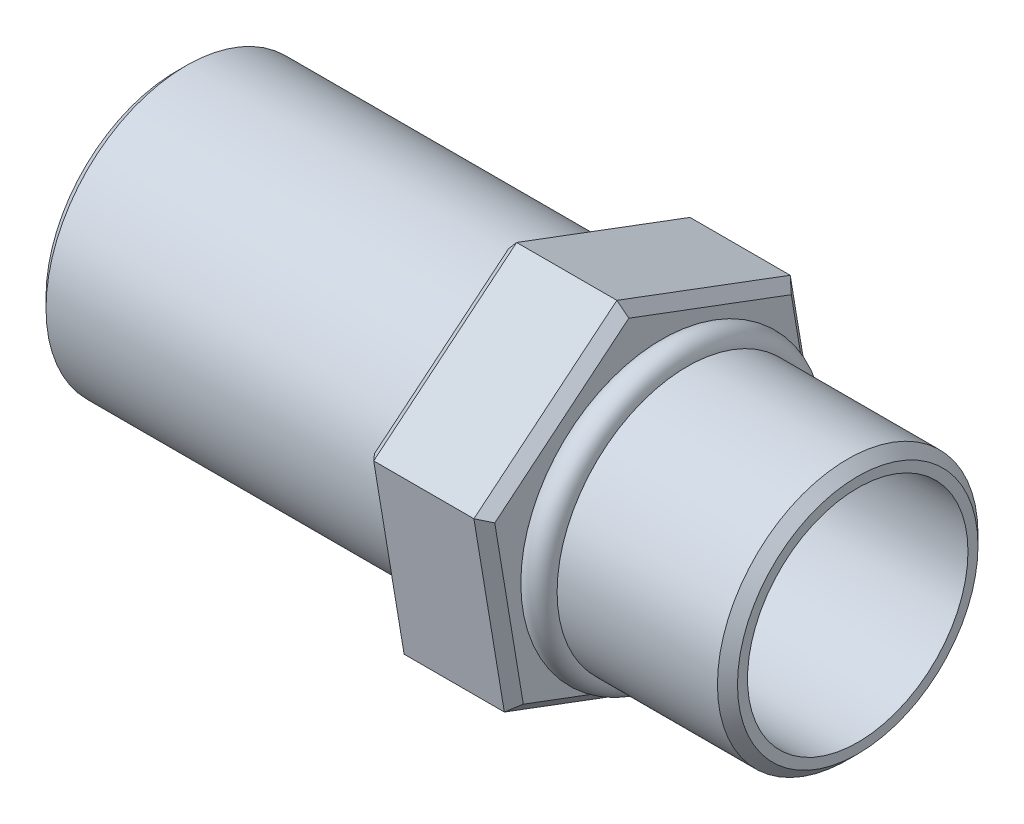
ISO-10303-21;
HEADER;
FILE_DESCRIPTION(('STEP AP214'),'2;1');
FILE_NAME('part.step','',(''),(''),'','','');
FILE_SCHEMA(('AUTOMOTIVE_DESIGN { 1 0 10303 214 1 1 1 1 }'));
ENDSEC;
DATA;
#1=APPLICATION_CONTEXT('core data for automotive mechanical design processes');
#2=APPLICATION_PROTOCOL_DEFINITION('international standard','automotive_design',2000,#1);
#3=PRODUCT_CONTEXT('',#1,'mechanical');
#4=PRODUCT('Part','Part','',(#3));
#5=PRODUCT_RELATED_PRODUCT_CATEGORY('part','',(#4));
#6=PRODUCT_DEFINITION_FORMATION('','',#4);
#7=PRODUCT_DEFINITION_CONTEXT('part definition',#1,'design');
#8=PRODUCT_DEFINITION('design','',#6,#7);
#9=PRODUCT_DEFINITION_SHAPE('','',#8);
#10=(LENGTH_UNIT() NAMED_UNIT(*) SI_UNIT(.MILLI.,.METRE.));
#11=(NAMED_UNIT(*) PLANE_ANGLE_UNIT() SI_UNIT($,.RADIAN.));
#12=(NAMED_UNIT(*) SI_UNIT($,.STERADIAN.) SOLID_ANGLE_UNIT());
#13=UNCERTAINTY_MEASURE_WITH_UNIT(LENGTH_MEASURE(1.E-05),#10,'distance_accuracy_value','');
#14=(GEOMETRIC_REPRESENTATION_CONTEXT(3) GLOBAL_UNCERTAINTY_ASSIGNED_CONTEXT((#13)) GLOBAL_UNIT_ASSIGNED_CONTEXT((#10,
#11,#12)) REPRESENTATION_CONTEXT('',''));
#15=CARTESIAN_POINT('',(0.,0.,0.));
#16=DIRECTION('',(0.,0.,1.));
#17=DIRECTION('',(1.,0.,0.));
#18=AXIS2_PLACEMENT_3D('',#15,#16,#17);
#19=CARTESIAN_POINT('',(10.,0.,0.));
#20=DIRECTION('',(-1.,0.,0.));
#21=DIRECTION('',(0.,0.,1.));
#22=AXIS2_PLACEMENT_3D('',#19,#20,#21);
#23=CYLINDRICAL_SURFACE('',#22,6.5);
#24=CARTESIAN_POINT('',(9.49999999999999,0.,0.));
#25=DIRECTION('',(1.,0.,0.));
#26=DIRECTION('',(0.,0.,-1.));
#27=AXIS2_PLACEMENT_3D('',#24,#25,#26);
#28=CIRCLE('',#27,6.5);
#29=CARTESIAN_POINT('',(9.49999999999999,0.,-6.5));
#30=VERTEX_POINT('',#29);
#31=EDGE_CURVE('E246',#30,#30,#28,.F.);
#32=ORIENTED_EDGE('',*,*,#31,.T.);
#33=EDGE_LOOP('',(#32));
#34=FACE_BOUND('',#33,.T.);
#35=CARTESIAN_POINT('',(1.5,0.,0.));
#36=DIRECTION('',(1.,0.,0.));
#37=DIRECTION('',(0.,0.,-1.));
#38=AXIS2_PLACEMENT_3D('',#35,#36,#37);
#39=CIRCLE('',#38,6.5);
#40=CARTESIAN_POINT('',(1.5,0.,-6.5));
#41=VERTEX_POINT('',#40);
#42=EDGE_CURVE('E161',#41,#41,#39,.T.);
#43=ORIENTED_EDGE('',*,*,#42,.T.);
#44=EDGE_LOOP('',(#43));
#45=FACE_BOUND('',#44,.T.);
#46=ADVANCED_FACE('F38',(#34,#45),#23,.T.);
#47=CARTESIAN_POINT('',(10.,0.,0.));
#48=DIRECTION('',(1.,0.,0.));
#49=DIRECTION('',(0.,0.,-1.));
#50=AXIS2_PLACEMENT_3D('',#47,#48,#49);
#51=PLANE('',#50);
#52=CARTESIAN_POINT('',(10.,0.,0.));
#53=DIRECTION('',(1.,0.,0.));
#54=DIRECTION('',(0.,0.,-1.));
#55=AXIS2_PLACEMENT_3D('',#52,#53,#54);
#56=CIRCLE('',#55,5.99999999999999);
#57=CARTESIAN_POINT('',(10.,0.,-5.99999999999999));
#58=VERTEX_POINT('',#57);
#59=EDGE_CURVE('E222',#58,#58,#56,.T.);
#60=ORIENTED_EDGE('',*,*,#59,.T.);
#61=EDGE_LOOP('',(#60));
#62=FACE_BOUND('',#61,.T.);
#63=CARTESIAN_POINT('',(10.,0.,0.));
#64=DIRECTION('',(1.,0.,0.));
#65=DIRECTION('',(0.,0.,-1.));
#66=AXIS2_PLACEMENT_3D('',#63,#64,#65);
#67=CIRCLE('',#66,5.5);
#68=CARTESIAN_POINT('',(10.,0.,-5.5));
#69=VERTEX_POINT('',#68);
#70=EDGE_CURVE('E243',#69,#69,#67,.T.);
#71=ORIENTED_EDGE('',*,*,#70,.F.);
#72=EDGE_LOOP('',(#71));
#73=FACE_BOUND('',#72,.T.);
#74=ADVANCED_FACE('F285',(#62,#73),#51,.T.);
#75=CARTESIAN_POINT('',(0.75,0.,0.));
#76=DIRECTION('',(1.,0.,0.));
#77=DIRECTION('',(0.,0.,-1.));
#78=AXIS2_PLACEMENT_3D('',#75,#76,#77);
#79=TOROIDAL_SURFACE('',#78,6.5,0.75);
#80=CARTESIAN_POINT('',(0.,0.,0.));
#81=DIRECTION('',(1.,0.,0.));
#82=DIRECTION('',(0.,0.,-1.));
#83=AXIS2_PLACEMENT_3D('',#80,#81,#82);
#84=CIRCLE('',#83,6.5);
#85=CARTESIAN_POINT('',(0.,0.,-6.5));
#86=VERTEX_POINT('',#85);
#87=EDGE_CURVE('E164',#86,#86,#84,.F.);
#88=ORIENTED_EDGE('',*,*,#87,.F.);
#89=EDGE_LOOP('',(#88));
#90=FACE_BOUND('',#89,.T.);
#91=ORIENTED_EDGE('',*,*,#42,.F.);
#92=EDGE_LOOP('',(#91));
#93=FACE_BOUND('',#92,.T.);
#94=ADVANCED_FACE('F291',(#90,#93),#79,.T.);
#95=CARTESIAN_POINT('',(-6.,-9.11201705266674,-1.51805090996447));
#96=DIRECTION('',(0.,0.936418514454213,-0.350885117648731));
#97=DIRECTION('',(0.,0.350885117648731,0.936418514454214));
#98=AXIS2_PLACEMENT_3D('',#95,#96,#97);
#99=PLANE('',#98);
#100=DIRECTION('',(1.,0.,0.));
#101=VECTOR('',#100,1.);
#102=CARTESIAN_POINT('',(-6.,-9.11201705266674,-1.51805090996447));
#103=LINE('',#102,#101);
#104=CARTESIAN_POINT('',(-5.5,-9.11201705266674,-1.51805090996447));
#105=VERTEX_POINT('',#104);
#106=CARTESIAN_POINT('',(-0.499999999999997,-9.11201705266674,-1.51805090996447));
#107=VERTEX_POINT('',#106);
#108=EDGE_CURVE('E198',#105,#107,#103,.T.);
#109=ORIENTED_EDGE('',*,*,#108,.T.);
#110=DIRECTION('',(0.,0.350885117648731,0.936418514454214));
#111=VECTOR('',#110,1.);
#112=CARTESIAN_POINT('',(-0.499999999999997,-9.11201705266674,-1.51805090996447));
#113=LINE('',#112,#111);
#114=CARTESIAN_POINT('',(-0.499999999999997,-5.87067917860069,7.13221279234417));
#115=VERTEX_POINT('',#114);
#116=EDGE_CURVE('E218',#107,#115,#113,.T.);
#117=ORIENTED_EDGE('',*,*,#116,.T.);
#118=DIRECTION('',(1.,0.,0.));
#119=VECTOR('',#118,1.);
#120=CARTESIAN_POINT('',(-6.,-5.87067917860069,7.13221279234417));
#121=LINE('',#120,#119);
#122=CARTESIAN_POINT('',(-5.5,-5.87067917860069,7.13221279234417));
#123=VERTEX_POINT('',#122);
#124=EDGE_CURVE('E376',#123,#115,#121,.T.);
#125=ORIENTED_EDGE('',*,*,#124,.F.);
#126=DIRECTION('',(0.,-0.350885117648731,-0.936418514454214));
#127=VECTOR('',#126,1.);
#128=CARTESIAN_POINT('',(-5.5,-9.11201705266674,-1.51805090996447));
#129=LINE('',#128,#127);
#130=EDGE_CURVE('E185',#123,#105,#129,.T.);
#131=ORIENTED_EDGE('',*,*,#130,.T.);
#132=EDGE_LOOP('',(#109,#117,#125,#131));
#133=FACE_BOUND('',#132,.T.);
#134=ADVANCED_FACE('F385',(#133),#99,.F.);
#135=CARTESIAN_POINT('',(-6.,-5.87067917860069,7.13221279234417));
#136=DIRECTION('',(0.,0.164333831533414,-0.9864047809158));
#137=DIRECTION('',(0.,0.9864047809158,0.164333831533414));
#138=AXIS2_PLACEMENT_3D('',#135,#136,#137);
#139=PLANE('',#138);
#140=ORIENTED_EDGE('',*,*,#124,.T.);
#141=DIRECTION('',(0.,0.9864047809158,0.164333831533414));
#142=VECTOR('',#141,1.);
#143=CARTESIAN_POINT('',(-0.499999999999997,-5.87067917860069,7.13221279234417));
#144=LINE('',#143,#142);
#145=CARTESIAN_POINT('',(-0.499999999999997,3.24133787406605,8.65026370230864));
#146=VERTEX_POINT('',#145);
#147=EDGE_CURVE('E216',#115,#146,#144,.T.);
#148=ORIENTED_EDGE('',*,*,#147,.T.);
#149=DIRECTION('',(1.,0.,0.));
#150=VECTOR('',#149,1.);
#151=CARTESIAN_POINT('',(-6.,3.24133787406605,8.65026370230864));
#152=LINE('',#151,#150);
#153=CARTESIAN_POINT('',(-5.5,3.24133787406605,8.65026370230864));
#154=VERTEX_POINT('',#153);
#155=EDGE_CURVE('E373',#154,#146,#152,.T.);
#156=ORIENTED_EDGE('',*,*,#155,.F.);
#157=DIRECTION('',(0.,-0.9864047809158,-0.164333831533414));
#158=VECTOR('',#157,1.);
#159=CARTESIAN_POINT('',(-5.5,-5.87067917860069,7.13221279234417));
#160=LINE('',#159,#158);
#161=EDGE_CURVE('E175',#154,#123,#160,.T.);
#162=ORIENTED_EDGE('',*,*,#161,.T.);
#163=EDGE_LOOP('',(#140,#148,#156,#162));
#164=FACE_BOUND('',#163,.T.);
#165=ADVANCED_FACE('F390',(#164),#139,.F.);
#166=CARTESIAN_POINT('',(-6.,3.24133787406605,8.65026370230864));
#167=DIRECTION('',(0.,-0.772084682920799,-0.635519663267069));
#168=DIRECTION('',(0.,0.635519663267069,-0.772084682920799));
#169=AXIS2_PLACEMENT_3D('',#166,#167,#168);
#170=PLANE('',#169);
#171=ORIENTED_EDGE('',*,*,#155,.T.);
#172=DIRECTION('',(0.,0.635519663267069,-0.772084682920799));
#173=VECTOR('',#172,1.);
#174=CARTESIAN_POINT('',(-0.499999999999997,3.24133787406605,8.65026370230864));
#175=LINE('',#174,#173);
#176=CARTESIAN_POINT('',(-0.499999999999997,9.11201705266674,1.51805090996447));
#177=VERTEX_POINT('',#176);
#178=EDGE_CURVE('E214',#146,#177,#175,.T.);
#179=ORIENTED_EDGE('',*,*,#178,.T.);
#180=DIRECTION('',(1.,0.,0.));
#181=VECTOR('',#180,1.);
#182=CARTESIAN_POINT('',(-6.,9.11201705266674,1.51805090996447));
#183=LINE('',#182,#181);
#184=CARTESIAN_POINT('',(-5.5,9.11201705266674,1.51805090996447));
#185=VERTEX_POINT('',#184);
#186=EDGE_CURVE('E370',#185,#177,#183,.T.);
#187=ORIENTED_EDGE('',*,*,#186,.F.);
#188=DIRECTION('',(0.,-0.635519663267069,0.772084682920799));
#189=VECTOR('',#188,1.);
#190=CARTESIAN_POINT('',(-5.5,3.24133787406605,8.65026370230864));
#191=LINE('',#190,#189);
#192=EDGE_CURVE('E178',#185,#154,#191,.T.);
#193=ORIENTED_EDGE('',*,*,#192,.T.);
#194=EDGE_LOOP('',(#171,#179,#187,#193));
#195=FACE_BOUND('',#194,.T.);
#196=ADVANCED_FACE('F396',(#195),#170,.F.);
#197=CARTESIAN_POINT('',(-6.,9.11201705266674,1.51805090996447));
#198=DIRECTION('',(0.,-0.936418514454214,0.350885117648731));
#199=DIRECTION('',(0.,-0.350885117648731,-0.936418514454214));
#200=AXIS2_PLACEMENT_3D('',#197,#198,#199);
#201=PLANE('',#200);
#202=ORIENTED_EDGE('',*,*,#186,.T.);
#203=DIRECTION('',(0.,-0.350885117648731,-0.936418514454214));
#204=VECTOR('',#203,1.);
#205=CARTESIAN_POINT('',(-0.499999999999997,9.11201705266674,1.51805090996447));
#206=LINE('',#205,#204);
#207=CARTESIAN_POINT('',(-0.499999999999997,5.87067917860068,-7.13221279234416));
#208=VERTEX_POINT('',#207);
#209=EDGE_CURVE('E187',#177,#208,#206,.T.);
#210=ORIENTED_EDGE('',*,*,#209,.T.);
#211=DIRECTION('',(1.,0.,0.));
#212=VECTOR('',#211,1.);
#213=CARTESIAN_POINT('',(-6.,5.87067917860068,-7.13221279234416));
#214=LINE('',#213,#212);
#215=CARTESIAN_POINT('',(-5.5,5.87067917860068,-7.13221279234416));
#216=VERTEX_POINT('',#215);
#217=EDGE_CURVE('E368',#216,#208,#214,.T.);
#218=ORIENTED_EDGE('',*,*,#217,.F.);
#219=DIRECTION('',(0.,0.350885117648731,0.936418514454214));
#220=VECTOR('',#219,1.);
#221=CARTESIAN_POINT('',(-5.5,9.11201705266674,1.51805090996447));
#222=LINE('',#221,#220);
#223=EDGE_CURVE('E180',#216,#185,#222,.T.);
#224=ORIENTED_EDGE('',*,*,#223,.T.);
#225=EDGE_LOOP('',(#202,#210,#218,#224));
#226=FACE_BOUND('',#225,.T.);
#227=ADVANCED_FACE('F400',(#226),#201,.F.);
#228=CARTESIAN_POINT('',(-6.,5.87067917860068,-7.13221279234416));
#229=DIRECTION('',(0.,-0.164333831533414,0.9864047809158));
#230=DIRECTION('',(0.,-0.9864047809158,-0.164333831533414));
#231=AXIS2_PLACEMENT_3D('',#228,#229,#230);
#232=PLANE('',#231);
#233=ORIENTED_EDGE('',*,*,#217,.T.);
#234=DIRECTION('',(0.,-0.9864047809158,-0.164333831533414));
#235=VECTOR('',#234,1.);
#236=CARTESIAN_POINT('',(-0.499999999999997,5.87067917860068,-7.13221279234416));
#237=LINE('',#236,#235);
#238=CARTESIAN_POINT('',(-0.499999999999997,-3.24133787406605,-8.65026370230864));
#239=VERTEX_POINT('',#238);
#240=EDGE_CURVE('E59',#208,#239,#237,.T.);
#241=ORIENTED_EDGE('',*,*,#240,.T.);
#242=DIRECTION('',(1.,0.,0.));
#243=VECTOR('',#242,1.);
#244=CARTESIAN_POINT('',(-6.,-3.24133787406605,-8.65026370230864));
#245=LINE('',#244,#243);
#246=CARTESIAN_POINT('',(-5.5,-3.24133787406605,-8.65026370230864));
#247=VERTEX_POINT('',#246);
#248=EDGE_CURVE('E366',#247,#239,#245,.T.);
#249=ORIENTED_EDGE('',*,*,#248,.F.);
#250=DIRECTION('',(0.,0.9864047809158,0.164333831533414));
#251=VECTOR('',#250,1.);
#252=CARTESIAN_POINT('',(-5.5,5.87067917860068,-7.13221279234416));
#253=LINE('',#252,#251);
#254=EDGE_CURVE('E182',#247,#216,#253,.T.);
#255=ORIENTED_EDGE('',*,*,#254,.T.);
#256=EDGE_LOOP('',(#233,#241,#249,#255));
#257=FACE_BOUND('',#256,.T.);
#258=ADVANCED_FACE('F404',(#257),#232,.F.);
#259=CARTESIAN_POINT('',(-6.,-3.24133787406605,-8.65026370230864));
#260=DIRECTION('',(0.,0.772084682920799,0.635519663267069));
#261=DIRECTION('',(0.,-0.635519663267069,0.772084682920799));
#262=AXIS2_PLACEMENT_3D('',#259,#260,#261);
#263=PLANE('',#262);
#264=ORIENTED_EDGE('',*,*,#248,.T.);
#265=DIRECTION('',(0.,-0.635519663267069,0.772084682920799));
#266=VECTOR('',#265,1.);
#267=CARTESIAN_POINT('',(-0.499999999999997,-3.24133787406605,-8.65026370230864));
#268=LINE('',#267,#266);
#269=EDGE_CURVE('E66',#239,#107,#268,.T.);
#270=ORIENTED_EDGE('',*,*,#269,.T.);
#271=ORIENTED_EDGE('',*,*,#108,.F.);
#272=DIRECTION('',(0.,0.635519663267069,-0.772084682920799));
#273=VECTOR('',#272,1.);
#274=CARTESIAN_POINT('',(-5.5,-3.24133787406605,-8.65026370230864));
#275=LINE('',#274,#273);
#276=EDGE_CURVE('E152',#105,#247,#275,.T.);
#277=ORIENTED_EDGE('',*,*,#276,.T.);
#278=EDGE_LOOP('',(#264,#270,#271,#277));
#279=FACE_BOUND('',#278,.T.);
#280=ADVANCED_FACE('F408',(#279),#263,.F.);
#281=CARTESIAN_POINT('',(-6.,0.,0.));
#282=DIRECTION('',(-1.,0.,0.));
#283=DIRECTION('',(0.,0.,1.));
#284=AXIS2_PLACEMENT_3D('',#281,#282,#283);
#285=PLANE('',#284);
#286=CARTESIAN_POINT('',(-6.,0.,0.));
#287=DIRECTION('',(-1.,0.,0.));
#288=DIRECTION('',(0.,0.,1.));
#289=AXIS2_PLACEMENT_3D('',#286,#287,#288);
#290=CIRCLE('',#289,7.1);
#291=CARTESIAN_POINT('',(-6.,0.,7.1));
#292=VERTEX_POINT('',#291);
#293=EDGE_CURVE('E11',#292,#292,#290,.F.);
#294=ORIENTED_EDGE('',*,*,#293,.T.);
#295=EDGE_LOOP('',(#294));
#296=FACE_BOUND('',#295,.T.);
#297=DIRECTION('',(0.,0.350885117648731,0.936418514454214));
#298=VECTOR('',#297,1.);
#299=CARTESIAN_POINT('',(-6.,-5.40246992137358,6.9567702335198));
#300=LINE('',#299,#298);
#301=CARTESIAN_POINT('',(-6.,-8.54251598687507,-1.42317272809169));
#302=VERTEX_POINT('',#301);
#303=CARTESIAN_POINT('',(-6.,-5.50376172993814,6.68644949282266));
#304=VERTEX_POINT('',#303);
#305=EDGE_CURVE('E140',#302,#304,#300,.T.);
#306=ORIENTED_EDGE('',*,*,#305,.T.);
#307=DIRECTION('',(0.,0.9864047809158,0.164333831533414));
#308=VECTOR('',#307,1.);
#309=CARTESIAN_POINT('',(-6.,3.32350478983276,8.15706131185074));
#310=LINE('',#309,#308);
#311=CARTESIAN_POINT('',(-6.,3.03875425693693,8.10962222091435));
#312=VERTEX_POINT('',#311);
#313=EDGE_CURVE('E173',#304,#312,#310,.T.);
#314=ORIENTED_EDGE('',*,*,#313,.T.);
#315=DIRECTION('',(0.,0.635519663267069,-0.772084682920799));
#316=VECTOR('',#315,1.);
#317=CARTESIAN_POINT('',(-6.,8.72597471120634,1.20029107833094));
#318=LINE('',#317,#316);
#319=CARTESIAN_POINT('',(-6.,8.54251598687507,1.42317272809169));
#320=VERTEX_POINT('',#319);
#321=EDGE_CURVE('E171',#312,#320,#318,.T.);
#322=ORIENTED_EDGE('',*,*,#321,.T.);
#323=DIRECTION('',(0.,-0.350885117648731,-0.936418514454214));
#324=VECTOR('',#323,1.);
#325=CARTESIAN_POINT('',(-6.,5.40246992137358,-6.9567702335198));
#326=LINE('',#325,#324);
#327=CARTESIAN_POINT('',(-6.,5.50376172993814,-6.68644949282266));
#328=VERTEX_POINT('',#327);
#329=EDGE_CURVE('E169',#320,#328,#326,.T.);
#330=ORIENTED_EDGE('',*,*,#329,.T.);
#331=DIRECTION('',(0.,-0.9864047809158,-0.164333831533414));
#332=VECTOR('',#331,1.);
#333=CARTESIAN_POINT('',(-6.,-3.32350478983276,-8.15706131185073));
#334=LINE('',#333,#332);
#335=CARTESIAN_POINT('',(-6.,-3.03875425693693,-8.10962222091434));
#336=VERTEX_POINT('',#335);
#337=EDGE_CURVE('E143',#328,#336,#334,.T.);
#338=ORIENTED_EDGE('',*,*,#337,.T.);
#339=DIRECTION('',(0.,-0.635519663267069,0.772084682920799));
#340=VECTOR('',#339,1.);
#341=CARTESIAN_POINT('',(-6.,-8.72597471120634,-1.20029107833093));
#342=LINE('',#341,#340);
#343=EDGE_CURVE('E135',#336,#302,#342,.T.);
#344=ORIENTED_EDGE('',*,*,#343,.T.);
#345=EDGE_LOOP('',(#306,#314,#322,#330,#338,#344));
#346=FACE_BOUND('',#345,.T.);
#347=ADVANCED_FACE('F137',(#296,#346),#285,.T.);
#348=CARTESIAN_POINT('',(0.,0.,0.));
#349=DIRECTION('',(-1.,0.,0.));
#350=DIRECTION('',(0.,0.,1.));
#351=AXIS2_PLACEMENT_3D('',#348,#349,#350);
#352=PLANE('',#351);
#353=DIRECTION('',(0.,0.9864047809158,0.164333831533414));
#354=VECTOR('',#353,1.);
#355=CARTESIAN_POINT('',(0.,1.23250373650061,-7.39803585686849));
#356=LINE('',#355,#354);
#357=CARTESIAN_POINT('',(0.,-3.03875425693692,-8.10962222091434));
#358=VERTEX_POINT('',#357);
#359=CARTESIAN_POINT('',(0.,5.50376172993814,-6.68644949282265));
#360=VERTEX_POINT('',#359);
#361=EDGE_CURVE('E201',#358,#360,#356,.T.);
#362=ORIENTED_EDGE('',*,*,#361,.T.);
#363=DIRECTION('',(0.,0.350885117648731,0.936418514454214));
#364=VECTOR('',#363,1.);
#365=CARTESIAN_POINT('',(0.,7.0231388584066,-2.63163838236548));
#366=LINE('',#365,#364);
#367=CARTESIAN_POINT('',(0.,8.54251598687506,1.42317272809169));
#368=VERTEX_POINT('',#367);
#369=EDGE_CURVE('E211',#360,#368,#366,.T.);
#370=ORIENTED_EDGE('',*,*,#369,.T.);
#371=DIRECTION('',(0.,-0.635519663267069,0.772084682920799));
#372=VECTOR('',#371,1.);
#373=CARTESIAN_POINT('',(0.,5.79063512190599,4.76639747450302));
#374=LINE('',#373,#372);
#375=CARTESIAN_POINT('',(0.,3.03875425693692,8.10962222091434));
#376=VERTEX_POINT('',#375);
#377=EDGE_CURVE('E209',#368,#376,#374,.T.);
#378=ORIENTED_EDGE('',*,*,#377,.T.);
#379=DIRECTION('',(0.,-0.9864047809158,-0.164333831533414));
#380=VECTOR('',#379,1.);
#381=CARTESIAN_POINT('',(0.,-1.23250373650061,7.3980358568685));
#382=LINE('',#381,#380);
#383=CARTESIAN_POINT('',(0.,-5.50376172993814,6.68644949282265));
#384=VERTEX_POINT('',#383);
#385=EDGE_CURVE('E207',#376,#384,#382,.T.);
#386=ORIENTED_EDGE('',*,*,#385,.T.);
#387=DIRECTION('',(0.,-0.350885117648731,-0.936418514454214));
#388=VECTOR('',#387,1.);
#389=CARTESIAN_POINT('',(0.,-7.0231388584066,2.63163838236548));
#390=LINE('',#389,#388);
#391=CARTESIAN_POINT('',(0.,-8.54251598687507,-1.42317272809169));
#392=VERTEX_POINT('',#391);
#393=EDGE_CURVE('E205',#384,#392,#390,.T.);
#394=ORIENTED_EDGE('',*,*,#393,.T.);
#395=DIRECTION('',(0.,0.635519663267069,-0.772084682920799));
#396=VECTOR('',#395,1.);
#397=CARTESIAN_POINT('',(0.,-5.79063512190599,-4.76639747450302));
#398=LINE('',#397,#396);
#399=EDGE_CURVE('E203',#392,#358,#398,.T.);
#400=ORIENTED_EDGE('',*,*,#399,.T.);
#401=EDGE_LOOP('',(#362,#370,#378,#386,#394,#400));
#402=FACE_BOUND('',#401,.T.);
#403=ORIENTED_EDGE('',*,*,#87,.T.);
#404=EDGE_LOOP('',(#403));
#405=FACE_BOUND('',#404,.T.);
#406=ADVANCED_FACE('F381',(#402,#405),#352,.F.);
#407=CARTESIAN_POINT('',(-24.,0.,0.));
#408=DIRECTION('',(1.,0.,0.));
#409=DIRECTION('',(0.,0.,-1.));
#410=AXIS2_PLACEMENT_3D('',#407,#408,#409);
#411=CYLINDRICAL_SURFACE('',#410,7.);
#412=CARTESIAN_POINT('',(-6.1,0.,0.));
#413=DIRECTION('',(-1.,0.,0.));
#414=DIRECTION('',(0.,0.,1.));
#415=AXIS2_PLACEMENT_3D('',#412,#413,#414);
#416=CIRCLE('',#415,7.);
#417=CARTESIAN_POINT('',(-6.1,0.,7.));
#418=VERTEX_POINT('',#417);
#419=EDGE_CURVE('E51',#418,#418,#416,.T.);
#420=ORIENTED_EDGE('',*,*,#419,.T.);
#421=EDGE_LOOP('',(#420));
#422=FACE_BOUND('',#421,.T.);
#423=CARTESIAN_POINT('',(-23.5,0.,0.));
#424=DIRECTION('',(-1.,0.,0.));
#425=DIRECTION('',(0.,0.,1.));
#426=AXIS2_PLACEMENT_3D('',#423,#424,#425);
#427=CIRCLE('',#426,7.);
#428=CARTESIAN_POINT('',(-23.5,0.,7.));
#429=VERTEX_POINT('',#428);
#430=EDGE_CURVE('E252',#429,#429,#427,.F.);
#431=ORIENTED_EDGE('',*,*,#430,.T.);
#432=EDGE_LOOP('',(#431));
#433=FACE_BOUND('',#432,.T.);
#434=ADVANCED_FACE('F356',(#422,#433),#411,.T.);
#435=CARTESIAN_POINT('',(-24.,0.,0.));
#436=DIRECTION('',(-1.,0.,0.));
#437=DIRECTION('',(0.,0.,1.));
#438=AXIS2_PLACEMENT_3D('',#435,#436,#437);
#439=PLANE('',#438);
#440=CARTESIAN_POINT('',(-24.,0.,0.));
#441=DIRECTION('',(-1.,0.,0.));
#442=DIRECTION('',(0.,0.,1.));
#443=AXIS2_PLACEMENT_3D('',#440,#441,#442);
#444=CIRCLE('',#443,6.49999999999999);
#445=CARTESIAN_POINT('',(-24.,0.,6.49999999999999));
#446=VERTEX_POINT('',#445);
#447=EDGE_CURVE('E249',#446,#446,#444,.T.);
#448=ORIENTED_EDGE('',*,*,#447,.T.);
#449=EDGE_LOOP('',(#448));
#450=FACE_BOUND('',#449,.T.);
#451=CARTESIAN_POINT('',(-24.,0.,0.));
#452=DIRECTION('',(-1.,0.,0.));
#453=DIRECTION('',(0.,0.,1.));
#454=AXIS2_PLACEMENT_3D('',#451,#452,#453);
#455=CIRCLE('',#454,5.75);
#456=CARTESIAN_POINT('',(-24.,0.,5.75));
#457=VERTEX_POINT('',#456);
#458=EDGE_CURVE('E242',#457,#457,#455,.T.);
#459=ORIENTED_EDGE('',*,*,#458,.F.);
#460=EDGE_LOOP('',(#459));
#461=FACE_BOUND('',#460,.T.);
#462=ADVANCED_FACE('F317',(#450,#461),#439,.T.);
#463=CARTESIAN_POINT('',(-6.,1.23250373650061,-7.3980358568685));
#464=DIRECTION('',(-0.707106781186547,0.116201566655645,-0.697493509580393));
#465=DIRECTION('',(0.,0.9864047809158,0.164333831533414));
#466=AXIS2_PLACEMENT_3D('',#463,#464,#465);
#467=PLANE('',#466);
#468=DIRECTION('',(0.654653670707978,0.480407709227477,-0.583641160597313));
#469=VECTOR('',#468,1.);
#470=CARTESIAN_POINT('',(-7.07142857142857,4.7175100542327,-5.73124242241942));
#471=LINE('',#470,#469);
#472=EDGE_CURVE('E155',#216,#328,#471,.F.);
#473=ORIENTED_EDGE('',*,*,#472,.F.);
#474=ORIENTED_EDGE('',*,*,#254,.F.);
#475=DIRECTION('',(0.654653670707978,-0.265244217157764,-0.70786586066354));
#476=VECTOR('',#475,1.);
#477=CARTESIAN_POINT('',(-7.07142857142858,-2.60464650594594,-6.95110476078372));
#478=LINE('',#477,#476);
#479=EDGE_CURVE('E196',#336,#247,#478,.T.);
#480=ORIENTED_EDGE('',*,*,#479,.F.);
#481=ORIENTED_EDGE('',*,*,#337,.F.);
#482=EDGE_LOOP('',(#473,#474,#480,#481));
#483=FACE_BOUND('',#482,.T.);
#484=ADVANCED_FACE('F314',(#483),#467,.T.);
#485=CARTESIAN_POINT('',(-6.,-5.79063512190599,-4.76639747450302));
#486=DIRECTION('',(-0.707106781186546,-0.545946314943564,-0.449380263473537));
#487=DIRECTION('',(0.,0.635519663267069,-0.772084682920799));
#488=AXIS2_PLACEMENT_3D('',#485,#486,#487);
#489=PLANE('',#488);
#490=ORIENTED_EDGE('',*,*,#479,.T.);
#491=ORIENTED_EDGE('',*,*,#276,.F.);
#492=DIRECTION('',(0.654653670707979,-0.745651926385244,-0.124224700066228));
#493=VECTOR('',#492,1.);
#494=CARTESIAN_POINT('',(-7.07142857142857,-7.32215656017864,-1.2198623383643));
#495=LINE('',#494,#493);
#496=EDGE_CURVE('E150',#302,#105,#495,.T.);
#497=ORIENTED_EDGE('',*,*,#496,.F.);
#498=ORIENTED_EDGE('',*,*,#343,.F.);
#499=EDGE_LOOP('',(#490,#491,#497,#498));
#500=FACE_BOUND('',#499,.T.);
#501=ADVANCED_FACE('F151',(#500),#489,.T.);
#502=CARTESIAN_POINT('',(-6.,7.0231388584066,-2.63163838236548));
#503=DIRECTION('',(-0.707106781186546,0.662147881599209,-0.248113246106858));
#504=DIRECTION('',(0.,0.350885117648731,0.936418514454214));
#505=AXIS2_PLACEMENT_3D('',#502,#503,#504);
#506=PLANE('',#505);
#507=ORIENTED_EDGE('',*,*,#472,.T.);
#508=ORIENTED_EDGE('',*,*,#329,.F.);
#509=DIRECTION('',(0.654653670707979,0.745651926385244,0.124224700066227));
#510=VECTOR('',#509,1.);
#511=CARTESIAN_POINT('',(-7.07142857142857,7.32215656017863,1.21986233836431));
#512=LINE('',#511,#510);
#513=EDGE_CURVE('E156',#185,#320,#512,.F.);
#514=ORIENTED_EDGE('',*,*,#513,.F.);
#515=ORIENTED_EDGE('',*,*,#223,.F.);
#516=EDGE_LOOP('',(#507,#508,#514,#515));
#517=FACE_BOUND('',#516,.T.);
#518=ADVANCED_FACE('F308',(#517),#506,.T.);
#519=CARTESIAN_POINT('',(-6.,-7.02313885840661,2.63163838236548));
#520=DIRECTION('',(-0.707106781186546,-0.662147881599209,0.248113246106858));
#521=DIRECTION('',(0.,-0.350885117648731,-0.936418514454214));
#522=AXIS2_PLACEMENT_3D('',#519,#520,#521);
#523=PLANE('',#522);
#524=ORIENTED_EDGE('',*,*,#496,.T.);
#525=ORIENTED_EDGE('',*,*,#130,.F.);
#526=DIRECTION('',(-0.654653670707979,0.480407709227478,-0.583641160597311));
#527=VECTOR('',#526,1.);
#528=CARTESIAN_POINT('',(-7.07142857142857,-4.7175100542327,5.73124242241943));
#529=LINE('',#528,#527);
#530=EDGE_CURVE('E159',#304,#123,#529,.F.);
#531=ORIENTED_EDGE('',*,*,#530,.F.);
#532=ORIENTED_EDGE('',*,*,#305,.F.);
#533=EDGE_LOOP('',(#524,#525,#531,#532));
#534=FACE_BOUND('',#533,.T.);
#535=ADVANCED_FACE('F158',(#534),#523,.T.);
#536=CARTESIAN_POINT('',(-6.,5.790635121906,4.76639747450302));
#537=DIRECTION('',(-0.707106781186546,0.545946314943564,0.449380263473537));
#538=DIRECTION('',(0.,-0.635519663267069,0.772084682920799));
#539=AXIS2_PLACEMENT_3D('',#536,#537,#538);
#540=PLANE('',#539);
#541=ORIENTED_EDGE('',*,*,#513,.T.);
#542=ORIENTED_EDGE('',*,*,#321,.F.);
#543=DIRECTION('',(0.654653670707979,0.265244217157766,0.707865860663539));
#544=VECTOR('',#543,1.);
#545=CARTESIAN_POINT('',(-7.07142857142857,2.60464650594594,6.95110476078373));
#546=LINE('',#545,#544);
#547=EDGE_CURVE('E188',#154,#312,#546,.F.);
#548=ORIENTED_EDGE('',*,*,#547,.F.);
#549=ORIENTED_EDGE('',*,*,#192,.F.);
#550=EDGE_LOOP('',(#541,#542,#548,#549));
#551=FACE_BOUND('',#550,.T.);
#552=ADVANCED_FACE('F301',(#551),#540,.T.);
#553=CARTESIAN_POINT('',(-6.,-1.23250373650061,7.3980358568685));
#554=DIRECTION('',(-0.707106781186546,-0.116201566655645,0.697493509580395));
#555=DIRECTION('',(0.,-0.9864047809158,-0.164333831533414));
#556=AXIS2_PLACEMENT_3D('',#553,#554,#555);
#557=PLANE('',#556);
#558=ORIENTED_EDGE('',*,*,#530,.T.);
#559=ORIENTED_EDGE('',*,*,#161,.F.);
#560=ORIENTED_EDGE('',*,*,#547,.T.);
#561=ORIENTED_EDGE('',*,*,#313,.F.);
#562=EDGE_LOOP('',(#558,#559,#560,#561));
#563=FACE_BOUND('',#562,.T.);
#564=ADVANCED_FACE('F297',(#563),#557,.T.);
#565=CARTESIAN_POINT('',(-0.499999999999997,-9.11201705266674,-1.51805090996447));
#566=DIRECTION('',(-0.707106781186552,0.662147881599203,-0.248113246106856));
#567=DIRECTION('',(0.,0.350885117648731,0.936418514454214));
#568=AXIS2_PLACEMENT_3D('',#565,#566,#567);
#569=PLANE('',#568);
#570=DIRECTION('',(-0.654653670707972,-0.745651926385249,-0.124224700066229));
#571=VECTOR('',#570,1.);
#572=CARTESIAN_POINT('',(1.78571428571429,-6.50858360904764,-1.08432207854604));
#573=LINE('',#572,#571);
#574=EDGE_CURVE('E234',#392,#107,#573,.T.);
#575=ORIENTED_EDGE('',*,*,#574,.F.);
#576=ORIENTED_EDGE('',*,*,#393,.F.);
#577=DIRECTION('',(-0.654653670707973,-0.480407709227482,0.583641160597315));
#578=VECTOR('',#577,1.);
#579=CARTESIAN_POINT('',(1.78571428571428,-4.19334227042905,5.09443770881725));
#580=LINE('',#579,#578);
#581=EDGE_CURVE('E190',#115,#384,#580,.F.);
#582=ORIENTED_EDGE('',*,*,#581,.F.);
#583=ORIENTED_EDGE('',*,*,#116,.F.);
#584=EDGE_LOOP('',(#575,#576,#582,#583));
#585=FACE_BOUND('',#584,.T.);
#586=ADVANCED_FACE('F300',(#585),#569,.F.);
#587=CARTESIAN_POINT('',(-0.499999999999997,-5.87067917860069,7.13221279234417));
#588=DIRECTION('',(-0.707106781186552,0.116201566655644,-0.697493509580389));
#589=DIRECTION('',(0.,0.9864047809158,0.164333831533414));
#590=AXIS2_PLACEMENT_3D('',#587,#588,#589);
#591=PLANE('',#590);
#592=ORIENTED_EDGE('',*,*,#581,.T.);
#593=ORIENTED_EDGE('',*,*,#385,.F.);
#594=DIRECTION('',(-0.654653670707973,0.265244217157768,0.707865860663544));
#595=VECTOR('',#594,1.);
#596=CARTESIAN_POINT('',(1.78571428571429,2.3152413386186,6.17875978736329));
#597=LINE('',#596,#595);
#598=EDGE_CURVE('E231',#146,#376,#597,.F.);
#599=ORIENTED_EDGE('',*,*,#598,.F.);
#600=ORIENTED_EDGE('',*,*,#147,.F.);
#601=EDGE_LOOP('',(#592,#593,#599,#600));
#602=FACE_BOUND('',#601,.T.);
#603=ADVANCED_FACE('F333',(#602),#591,.F.);
#604=CARTESIAN_POINT('',(-0.499999999999997,-3.24133787406605,-8.65026370230864));
#605=DIRECTION('',(-0.707106781186552,0.545946314943559,0.449380263473533));
#606=DIRECTION('',(0.,-0.635519663267069,0.772084682920799));
#607=AXIS2_PLACEMENT_3D('',#604,#605,#606);
#608=PLANE('',#607);
#609=ORIENTED_EDGE('',*,*,#574,.T.);
#610=ORIENTED_EDGE('',*,*,#269,.F.);
#611=DIRECTION('',(-0.654653670707972,-0.265244217157766,-0.707865860663546));
#612=VECTOR('',#611,1.);
#613=CARTESIAN_POINT('',(1.78571428571427,-2.31524133861861,-6.17875978736329));
#614=LINE('',#613,#612);
#615=EDGE_CURVE('E228',#358,#239,#614,.T.);
#616=ORIENTED_EDGE('',*,*,#615,.F.);
#617=ORIENTED_EDGE('',*,*,#399,.F.);
#618=EDGE_LOOP('',(#609,#610,#616,#617));
#619=FACE_BOUND('',#618,.T.);
#620=ADVANCED_FACE('F329',(#619),#608,.F.);
#621=CARTESIAN_POINT('',(-0.499999999999997,3.24133787406605,8.65026370230864));
#622=DIRECTION('',(-0.707106781186552,-0.545946314943559,-0.449380263473533));
#623=DIRECTION('',(0.,0.635519663267069,-0.772084682920799));
#624=AXIS2_PLACEMENT_3D('',#621,#622,#623);
#625=PLANE('',#624);
#626=ORIENTED_EDGE('',*,*,#598,.T.);
#627=ORIENTED_EDGE('',*,*,#377,.F.);
#628=DIRECTION('',(-0.654653670707973,0.745651926385249,0.124224700066229));
#629=VECTOR('',#628,1.);
#630=CARTESIAN_POINT('',(1.78571428571428,6.50858360904764,1.08432207854605));
#631=LINE('',#630,#629);
#632=EDGE_CURVE('E225',#177,#368,#631,.F.);
#633=ORIENTED_EDGE('',*,*,#632,.F.);
#634=ORIENTED_EDGE('',*,*,#178,.F.);
#635=EDGE_LOOP('',(#626,#627,#633,#634));
#636=FACE_BOUND('',#635,.T.);
#637=ADVANCED_FACE('F325',(#636),#625,.F.);
#638=CARTESIAN_POINT('',(-0.499999999999997,5.87067917860068,-7.13221279234416));
#639=DIRECTION('',(-0.707106781186553,-0.116201566655644,0.697493509580387));
#640=DIRECTION('',(0.,-0.9864047809158,-0.164333831533414));
#641=AXIS2_PLACEMENT_3D('',#638,#639,#640);
#642=PLANE('',#641);
#643=ORIENTED_EDGE('',*,*,#615,.T.);
#644=ORIENTED_EDGE('',*,*,#240,.F.);
#645=DIRECTION('',(0.654653670707972,-0.480407709227479,0.583641160597318));
#646=VECTOR('',#645,1.);
#647=CARTESIAN_POINT('',(-0.499999999999997,5.87067917860068,-7.13221279234416));
#648=LINE('',#647,#646);
#649=EDGE_CURVE('E223',#360,#208,#648,.F.);
#650=ORIENTED_EDGE('',*,*,#649,.F.);
#651=ORIENTED_EDGE('',*,*,#361,.F.);
#652=EDGE_LOOP('',(#643,#644,#650,#651));
#653=FACE_BOUND('',#652,.T.);
#654=ADVANCED_FACE('F321',(#653),#642,.F.);
#655=CARTESIAN_POINT('',(-0.499999999999997,9.11201705266674,1.51805090996447));
#656=DIRECTION('',(-0.707106781186552,-0.662147881599204,0.248113246106856));
#657=DIRECTION('',(0.,-0.350885117648731,-0.936418514454214));
#658=AXIS2_PLACEMENT_3D('',#655,#656,#657);
#659=PLANE('',#658);
#660=ORIENTED_EDGE('',*,*,#632,.T.);
#661=ORIENTED_EDGE('',*,*,#369,.F.);
#662=ORIENTED_EDGE('',*,*,#649,.T.);
#663=ORIENTED_EDGE('',*,*,#209,.F.);
#664=EDGE_LOOP('',(#660,#661,#662,#663));
#665=FACE_BOUND('',#664,.T.);
#666=ADVANCED_FACE('F280',(#665),#659,.F.);
#667=CARTESIAN_POINT('',(0.,0.,0.));
#668=DIRECTION('',(-1.,0.,0.));
#669=DIRECTION('',(0.,0.,1.));
#670=AXIS2_PLACEMENT_3D('',#667,#668,#669);
#671=CYLINDRICAL_SURFACE('',#670,5.75);
#672=CARTESIAN_POINT('',(-3.,-4.87819965525908,-3.04395599893136));
#673=CARTESIAN_POINT('',(-3.04193512697324,-4.87819901076158,-3.04395776544992));
#674=CARTESIAN_POINT('',(-3.08389608734036,-4.8763180249438,-3.04697790819358));
#675=CARTESIAN_POINT('',(-3.16664913809242,-4.86881453318987,-3.05895293303782));
#676=CARTESIAN_POINT('',(-3.2074399782276,-4.86318817013243,-3.06791393320362));
#677=CARTESIAN_POINT('',(-3.28664274068701,-4.84827438872773,-3.09142815581008));
#678=CARTESIAN_POINT('',(-3.32505629862009,-4.83898952063452,-3.10597748258772));
#679=CARTESIAN_POINT('',(-3.39845612803409,-4.81689304492557,-3.1401358594021));
#680=CARTESIAN_POINT('',(-3.43344296093415,-4.80408201633492,-3.15974407869324));
#681=CARTESIAN_POINT('',(-3.49921580650813,-4.77504679827824,-3.20345410710029));
#682=CARTESIAN_POINT('',(-3.52997795770077,-4.75880443918383,-3.22757975643181));
#683=CARTESIAN_POINT('',(-3.58622196083087,-4.72321916590941,-3.27943402513951));
#684=CARTESIAN_POINT('',(-3.61170354465347,-4.70387609438259,-3.30716282734548));
#685=CARTESIAN_POINT('',(-3.65674922425948,-4.66237675694682,-3.3654159490577));
#686=CARTESIAN_POINT('',(-3.67629164017435,-4.64021059377146,-3.39594999291623));
#687=CARTESIAN_POINT('',(-3.70876533332209,-4.5935959489664,-3.45874305140034));
#688=CARTESIAN_POINT('',(-3.72169687682497,-4.56914755930619,-3.49100199649323));
#689=CARTESIAN_POINT('',(-3.74051021965545,-4.51870596829467,-3.55604833151839));
#690=CARTESIAN_POINT('',(-3.74643176132181,-4.49272236113533,-3.58883166395569));
#691=CARTESIAN_POINT('',(-3.75118022465521,-4.43978058507812,-3.65412292073812));
#692=CARTESIAN_POINT('',(-3.75000744878676,-4.41282245777738,-3.68663085676553));
#693=CARTESIAN_POINT('',(-3.74063231911016,-4.35888188567561,-3.75025040936077));
#694=CARTESIAN_POINT('',(-3.73247270993891,-4.33190058334353,-3.78136930837006));
#695=CARTESIAN_POINT('',(-3.70942240963655,-4.27857946799378,-3.84159817718141));
#696=CARTESIAN_POINT('',(-3.69453158103038,-4.25223966808942,-3.87070810593927));
#697=CARTESIAN_POINT('',(-3.65839642711298,-4.2009772762603,-3.92628639920218));
#698=CARTESIAN_POINT('',(-3.63713370595225,-4.17605903979761,-3.95274681532472));
#699=CARTESIAN_POINT('',(-3.58887172877282,-4.12856486735657,-4.00232840503457));
#700=CARTESIAN_POINT('',(-3.5618721864054,-4.10598904838181,-4.02544941184122));
#701=CARTESIAN_POINT('',(-3.50266383432833,-4.06381860894889,-4.06801974055981));
#702=CARTESIAN_POINT('',(-3.47041775768675,-4.04424742136882,-4.08744046154231));
#703=CARTESIAN_POINT('',(-3.40175941842535,-4.00902030539681,-4.12199794327683));
#704=CARTESIAN_POINT('',(-3.3653471405649,-3.99336439132824,-4.13713468835669));
#705=CARTESIAN_POINT('',(-3.28935593648632,-3.96657222170964,-4.16282971627858));
#706=CARTESIAN_POINT('',(-3.24977547411177,-3.95543817476204,-4.17338576195483));
#707=CARTESIAN_POINT('',(-3.16858932712356,-3.93815503451797,-4.18969897093527));
#708=CARTESIAN_POINT('',(-3.12698374923485,-3.93200567882579,-4.19545638684127));
#709=CARTESIAN_POINT('',(-3.0432554431242,-3.92497513060431,-4.20203446196133));
#710=CARTESIAN_POINT('',(-3.00113875380309,-3.92405559420911,-4.20289105320305));
#711=CARTESIAN_POINT('',(-2.91729726379416,-3.92742031827054,-4.1997469849094));
#712=CARTESIAN_POINT('',(-2.87557245401372,-3.93170445768639,-4.19574643835412));
#713=CARTESIAN_POINT('',(-2.79385636497178,-3.94527241736357,-4.18299065736726));
#714=CARTESIAN_POINT('',(-2.75385925083672,-3.95453770831993,-4.17425304326741));
#715=CARTESIAN_POINT('',(-2.67655109003963,-3.97768220551433,-4.1522040208558));
#716=CARTESIAN_POINT('',(-2.63924014570941,-3.99156158741684,-4.13889243840644));
#717=CARTESIAN_POINT('',(-2.56812811655145,-4.02348697480982,-4.10786429015204));
#718=CARTESIAN_POINT('',(-2.53434840238405,-4.04155643409606,-4.09012288398433));
#719=CARTESIAN_POINT('',(-2.4714760970157,-4.08113879607284,-4.05062783070486));
#720=CARTESIAN_POINT('',(-2.44238370478875,-4.10265184486446,-4.02887401335268));
#721=CARTESIAN_POINT('',(-2.38952798555954,-4.14849049664351,-3.98165968146744));
#722=CARTESIAN_POINT('',(-2.36579896049355,-4.17283277465399,-3.95617693502003));
#723=CARTESIAN_POINT('',(-2.32458123229522,-4.22336965879917,-3.90218069855293));
#724=CARTESIAN_POINT('',(-2.30709239391925,-4.24956422477447,-3.87366727423452));
#725=CARTESIAN_POINT('',(-2.27890775775987,-4.30284938902453,-3.81438978849431));
#726=CARTESIAN_POINT('',(-2.26819235343642,-4.32993716008138,-3.78363251314607));
#727=CARTESIAN_POINT('',(-2.25379503514197,-4.3842164526945,-3.72060141265492));
#728=CARTESIAN_POINT('',(-2.2501127743675,-4.41140796906884,-3.68832766236961));
#729=CARTESIAN_POINT('',(-2.24989315064246,-4.46487866130273,-3.62341192199325));
#730=CARTESIAN_POINT('',(-2.25330297992527,-4.49116310932868,-3.59077444056328));
#731=CARTESIAN_POINT('',(-2.26705862696989,-4.54231080263406,-3.5258503972346));
#732=CARTESIAN_POINT('',(-2.27740443681336,-4.56717404953594,-3.49356383493531));
#733=CARTESIAN_POINT('',(-2.30472133310686,-4.61485337930545,-3.43033479915198));
#734=CARTESIAN_POINT('',(-2.3216896579638,-4.63767031061705,-3.39939177138217));
#735=CARTESIAN_POINT('',(-2.36176443116311,-4.68076759664722,-3.3398006853775));
#736=CARTESIAN_POINT('',(-2.38487097859335,-4.70104791041001,-3.3111526642001));
#737=CARTESIAN_POINT('',(-2.43676082809498,-4.73881362865836,-3.25687704072131));
#738=CARTESIAN_POINT('',(-2.4655833761736,-4.75627810593348,-3.23127239538285));
#739=CARTESIAN_POINT('',(-2.52800515062434,-4.78793587425914,-3.18417610814875));
#740=CARTESIAN_POINT('',(-2.56160550408846,-4.80212839137228,-3.16268543956153));
#741=CARTESIAN_POINT('',(-2.63279217674166,-4.8270661085951,-3.1244930456639));
#742=CARTESIAN_POINT('',(-2.67039465831323,-4.83779656609996,-3.10781183184529));
#743=CARTESIAN_POINT('',(-2.74838391767704,-4.85556085387284,-3.07998437825833));
#744=CARTESIAN_POINT('',(-2.78876764148829,-4.86259866793259,-3.06883217426158));
#745=CARTESIAN_POINT('',(-2.85779589932068,-4.87122338102628,-3.05511428481682));
#746=CARTESIAN_POINT('',(-2.88600670678761,-4.87383744531091,-3.05093747914202));
#747=CARTESIAN_POINT('',(-2.9428076724145,-4.87732579477619,-3.04535774563312));
#748=CARTESIAN_POINT('',(-2.97139782732638,-4.8782000948435,-3.04395479406393));
#749=CARTESIAN_POINT('',(-3.,-4.87819965525908,-3.04395599893136));
#750=B_SPLINE_CURVE_WITH_KNOTS('',3,(#672,#673,#674,#675,#676,#677,#678,#679,#680,#681,#682,
#683,#684,#685,#686,#687,#688,#689,#690,#691,#692,#693,#694,#695,#696,#697,#698,#699,#700,#701,
#702,#703,#704,#705,#706,#707,#708,#709,#710,#711,#712,#713,#714,#715,#716,#717,#718,#719,#720,
#721,#722,#723,#724,#725,#726,#727,#728,#729,#730,#731,#732,#733,#734,#735,#736,#737,#738,#739,
#740,#741,#742,#743,#744,#745,#746,#747,#748,#749),.UNSPECIFIED.,.T.,.F.,(4,2,2,2,2,2,2,2,2,2,2,
2,2,2,2,2,2,2,2,2,2,2,2,2,2,2,2,2,2,2,2,2,2,2,2,2,2,2,4),(0.,0.125700881704886,
0.251531415281806,0.377274390217022,0.502996729408562,0.629402274542159,0.755814236203471,
0.882682247905162,1.00954514926638,1.1356853191131,1.26182011104218,1.38718869376103,
1.5125598370606,1.63829647600067,1.7640393924562,1.89071795403495,2.01739697903882,
2.14413780331451,2.27087195548053,2.39667571134548,2.52247654099173,2.64781261176287,
2.77315345478838,2.89921358749967,3.02527906997879,3.15212933571178,3.27897685205109,
3.40545549066205,3.53192789246576,3.65746195187137,3.78299586796327,3.90847749216479,
4.03396114210968,4.16033820951976,4.28674513909584,4.41368345685993,4.54048454473463,
4.62622052189204,4.71195576542766),.UNSPECIFIED.);
#751=CARTESIAN_POINT('',(-3.,-4.87819965525908,-3.04395599893136));
#752=VERTEX_POINT('',#751);
#753=EDGE_CURVE('E42',#752,#752,#750,.T.);
#754=ORIENTED_EDGE('',*,*,#753,.T.);
#755=EDGE_LOOP('',(#754));
#756=FACE_BOUND('',#755,.T.);
#757=CARTESIAN_POINT('',(-3.,3.92492016035848,4.20208302331256));
#758=CARTESIAN_POINT('',(-2.95806487302675,3.92492177004002,4.20208205125794));
#759=CARTESIAN_POINT('',(-2.91610391265963,3.92752400611578,4.19965558525884));
#760=CARTESIAN_POINT('',(-2.83335086190758,3.9378333041095,4.18999008044025));
#761=CARTESIAN_POINT('',(-2.79256002177239,3.94554562853817,4.18274608036208));
#762=CARTESIAN_POINT('',(-2.71335725931299,3.96575444181576,4.16359031343709));
#763=CARTESIAN_POINT('',(-2.6749437013799,3.9782475978899,4.15168179814348));
#764=CARTESIAN_POINT('',(-2.60154387196591,4.0075213260066,4.12343117359289));
#765=CARTESIAN_POINT('',(-2.56655703906584,4.02430119410268,4.10708979225599));
#766=CARTESIAN_POINT('',(-2.50078419349187,4.06161460438836,4.07019372357928));
#767=CARTESIAN_POINT('',(-2.47002204229923,4.08216804943459,4.04961662268166));
#768=CARTESIAN_POINT('',(-2.41377803916912,4.12621469596286,4.00472709398241));
#769=CARTESIAN_POINT('',(-2.38829645534652,4.14970804661822,3.98041447662323));
#770=CARTESIAN_POINT('',(-2.34325077574051,4.19889734982647,3.92849113267551));
#771=CARTESIAN_POINT('',(-2.32370835982564,4.22460094282571,3.90086882409711));
#772=CARTESIAN_POINT('',(-2.2912346666779,4.2772621999085,3.84305286344132));
#773=CARTESIAN_POINT('',(-2.27830312317502,4.3042198134354,3.81285931498444));
#774=CARTESIAN_POINT('',(-2.25948978034455,4.35835667142742,3.75085463442942));
#775=CARTESIAN_POINT('',(-2.25356823867818,4.38553377835676,3.71905369756183));
#776=CARTESIAN_POINT('',(-2.24881977534478,4.4394303809549,3.65454837923305));
#777=CARTESIAN_POINT('',(-2.24999255121324,4.46614989608433,3.62184403634752));
#778=CARTESIAN_POINT('',(-2.25936768088984,4.51821397370663,3.55667990041045));
#779=CARTESIAN_POINT('',(-2.26752729006109,4.54356590243966,3.52421982862062));
#780=CARTESIAN_POINT('',(-2.29057759036345,4.59242161041734,3.4603153860643));
#781=CARTESIAN_POINT('',(-2.30546841896961,4.61592535190403,3.42887103605645));
#782=CARTESIAN_POINT('',(-2.34160357288702,4.66061296501291,3.36788089970072));
#783=CARTESIAN_POINT('',(-2.36286629404774,4.68178987373833,3.33834091549924));
#784=CARTESIAN_POINT('',(-2.41112827122718,4.72131698482911,3.2822014646395));
#785=CARTESIAN_POINT('',(-2.43812781359459,4.73966704601582,3.25560214486289));
#786=CARTESIAN_POINT('',(-2.49733616567167,4.77333703478025,3.20603491066753));
#787=CARTESIAN_POINT('',(-2.52958224231325,4.78863339932678,3.18309549004638));
#788=CARTESIAN_POINT('',(-2.59824058157464,4.81577469244297,3.14188239198863));
#789=CARTESIAN_POINT('',(-2.63465285943509,4.82761960838613,3.12360873162091));
#790=CARTESIAN_POINT('',(-2.71064406351368,4.84768517814226,3.09237689332822));
#791=CARTESIAN_POINT('',(-2.75022452588823,4.8559040610712,3.07942131286455));
#792=CARTESIAN_POINT('',(-2.83141067287643,4.86859069895895,3.05932462301171));
#793=CARTESIAN_POINT('',(-2.87301625076514,4.87305865136834,3.05218320756301));
#794=CARTESIAN_POINT('',(-2.95674455687579,4.87816256648098,3.04401927890686));
#795=CARTESIAN_POINT('',(-2.9988612461969,4.87882642025665,3.04295222975053));
#796=CARTESIAN_POINT('',(-3.08270273620583,4.87638778812623,3.04685858441662));
#797=CARTESIAN_POINT('',(-3.12442754598627,4.87328538982555,3.05183184773754));
#798=CARTESIAN_POINT('',(-3.20614363502822,4.8633756665237,3.06759880249956));
#799=CARTESIAN_POINT('',(-3.24614074916328,4.8565820713557,3.07837092305945));
#800=CARTESIAN_POINT('',(-3.32344890996036,4.8393933187886,3.10532224816373));
#801=CARTESIAN_POINT('',(-3.36075985429059,4.82899802426748,3.12150165857082));
#802=CARTESIAN_POINT('',(-3.43187188344854,4.80468555286172,3.15879616323885));
#803=CARTESIAN_POINT('',(-3.46565159761594,4.79074850739908,3.17993904893302));
#804=CARTESIAN_POINT('',(-3.5285239029843,4.75959893529801,3.22637531462191));
#805=CARTESIAN_POINT('',(-3.55761629521125,4.7423862696791,3.25166887071815));
#806=CARTESIAN_POINT('',(-3.61047201444046,4.70486402710936,3.30572861955986));
#807=CARTESIAN_POINT('',(-3.63420103950644,4.6845358383011,3.33451544996924));
#808=CARTESIAN_POINT('',(-3.67541876770478,4.64126131263115,3.39448949135179));
#809=CARTESIAN_POINT('',(-3.69290760608074,4.6183150325256,3.42567665028482));
#810=CARTESIAN_POINT('',(-3.72109224224013,4.57038605345795,3.48936292832309));
#811=CARTESIAN_POINT('',(-3.73180764656357,4.54540947053438,3.52185796845444));
#812=CARTESIAN_POINT('',(-3.74620496485803,4.49398798246141,3.58724138990107));
#813=CARTESIAN_POINT('',(-3.74988722563249,4.46754314977739,3.62012975174123));
#814=CARTESIAN_POINT('',(-3.75010684935753,4.41411673350284,3.68508193662088));
#815=CARTESIAN_POINT('',(-3.74669702007473,4.38714058795282,3.71715006680311));
#816=CARTESIAN_POINT('',(-3.7329413730301,4.3332594746182,3.77982417276743));
#817=CARTESIAN_POINT('',(-3.72259556318664,4.30635450675238,3.81043015021872));
#818=CARTESIAN_POINT('',(-3.69527866689314,4.25347006722356,3.86937474716435));
#819=CARTESIAN_POINT('',(-3.67831034203619,4.2274902147082,3.89771430582925));
#820=CARTESIAN_POINT('',(-3.63823556883689,4.17729507313132,3.95146299285004));
#821=CARTESIAN_POINT('',(-3.61512902140664,4.15307981256322,3.97687207389043));
#822=CARTESIAN_POINT('',(-3.56323917190501,4.10707611542172,4.0243668381086));
#823=CARTESIAN_POINT('',(-3.53441662382639,4.08530618483628,4.04642757136265));
#824=CARTESIAN_POINT('',(-3.47199484937565,4.04517380103303,4.08654821862645));
#825=CARTESIAN_POINT('',(-3.43839449591154,4.02681215419782,4.10460718603412));
#826=CARTESIAN_POINT('',(-3.36720782325834,3.99412581391378,4.13642152007954));
#827=CARTESIAN_POINT('',(-3.32960534168677,3.97981841545355,4.15015847614798));
#828=CARTESIAN_POINT('',(-3.25161608232295,3.95592476443029,4.17294071778462));
#829=CARTESIAN_POINT('',(-3.2112323585117,3.94633342467409,4.18199105934756));
#830=CARTESIAN_POINT('',(-3.14220410067932,3.93452929834723,4.19309190474));
#831=CARTESIAN_POINT('',(-3.11399329321238,3.9309328904276,4.19646012204368));
#832=CARTESIAN_POINT('',(-3.05719232758549,3.92612778270083,4.20095600324277));
#833=CARTESIAN_POINT('',(-3.02860217267361,3.92491906246292,4.20208368630981));
#834=CARTESIAN_POINT('',(-3.,3.92492016035848,4.20208302331256));
#835=B_SPLINE_CURVE_WITH_KNOTS('',3,(#757,#758,#759,#760,#761,#762,#763,#764,#765,#766,#767,
#768,#769,#770,#771,#772,#773,#774,#775,#776,#777,#778,#779,#780,#781,#782,#783,#784,#785,#786,
#787,#788,#789,#790,#791,#792,#793,#794,#795,#796,#797,#798,#799,#800,#801,#802,#803,#804,#805,
#806,#807,#808,#809,#810,#811,#812,#813,#814,#815,#816,#817,#818,#819,#820,#821,#822,#823,#824,
#825,#826,#827,#828,#829,#830,#831,#832,#833,#834),.UNSPECIFIED.,.T.,.F.,(4,2,2,2,2,2,2,2,2,2,2,
2,2,2,2,2,2,2,2,2,2,2,2,2,2,2,2,2,2,2,2,2,2,2,2,2,2,2,4),(0.,0.125700881704885,
0.251531415281805,0.377274390217021,0.50299672940856,0.629402274542158,0.75581423620347,
0.882682247905162,1.00954514926638,1.1356853191131,1.26182011104218,1.38718869376103,
1.5125598370606,1.63829647600066,1.7640393924562,1.89071795403495,2.01739697903881,
2.14413780331451,2.27087195548053,2.39667571134548,2.52247654099173,2.64781261176287,
2.77315345478838,2.89921358749967,3.02527906997879,3.15212933571178,3.27897685205109,
3.40545549066205,3.53192789246575,3.65746195187137,3.78299586796327,3.90847749216479,
4.03396114210968,4.16033820951976,4.28674513909584,4.41368345685993,4.54048454473463,
4.62622052189204,4.71195576542767),.UNSPECIFIED.);
#836=CARTESIAN_POINT('',(-3.,3.92492016035848,4.20208302331256));
#837=VERTEX_POINT('',#836);
#838=EDGE_CURVE('E256',#837,#837,#835,.T.);
#839=ORIENTED_EDGE('',*,*,#838,.T.);
#840=EDGE_LOOP('',(#839));
#841=FACE_BOUND('',#840,.T.);
#842=CARTESIAN_POINT('',(0.,0.,0.));
#843=DIRECTION('',(-1.,0.,0.));
#844=DIRECTION('',(0.,0.,1.));
#845=AXIS2_PLACEMENT_3D('',#842,#843,#844);
#846=CIRCLE('',#845,5.75);
#847=CARTESIAN_POINT('',(0.,0.,5.75));
#848=VERTEX_POINT('',#847);
#849=EDGE_CURVE('E226',#848,#848,#846,.T.);
#850=ORIENTED_EDGE('',*,*,#849,.F.);
#851=EDGE_LOOP('',(#850));
#852=FACE_BOUND('',#851,.T.);
#853=ORIENTED_EDGE('',*,*,#458,.T.);
#854=EDGE_LOOP('',(#853));
#855=FACE_BOUND('',#854,.T.);
#856=ADVANCED_FACE('F260',(#756,#841,#852,#855),#671,.F.);
#857=CARTESIAN_POINT('',(0.,0.,0.));
#858=DIRECTION('',(-1.,0.,0.));
#859=DIRECTION('',(0.,0.,1.));
#860=AXIS2_PLACEMENT_3D('',#857,#858,#859);
#861=PLANE('',#860);
#862=CARTESIAN_POINT('',(0.,0.,0.));
#863=DIRECTION('',(-1.,0.,0.));
#864=DIRECTION('',(0.,0.,1.));
#865=AXIS2_PLACEMENT_3D('',#862,#863,#864);
#866=CIRCLE('',#865,5.5);
#867=CARTESIAN_POINT('',(0.,0.,5.5));
#868=VERTEX_POINT('',#867);
#869=EDGE_CURVE('E239',#868,#868,#866,.T.);
#870=ORIENTED_EDGE('',*,*,#869,.F.);
#871=EDGE_LOOP('',(#870));
#872=FACE_BOUND('',#871,.T.);
#873=ORIENTED_EDGE('',*,*,#849,.T.);
#874=EDGE_LOOP('',(#873));
#875=FACE_BOUND('',#874,.T.);
#876=ADVANCED_FACE('F273',(#872,#875),#861,.T.);
#877=CARTESIAN_POINT('',(-14.,0.,0.));
#878=DIRECTION('',(1.,0.,0.));
#879=DIRECTION('',(0.,0.,-1.));
#880=AXIS2_PLACEMENT_3D('',#877,#878,#879);
#881=CYLINDRICAL_SURFACE('',#880,5.5);
#882=ORIENTED_EDGE('',*,*,#869,.T.);
#883=EDGE_LOOP('',(#882));
#884=FACE_BOUND('',#883,.T.);
#885=ORIENTED_EDGE('',*,*,#70,.T.);
#886=EDGE_LOOP('',(#885));
#887=FACE_BOUND('',#886,.T.);
#888=ADVANCED_FACE('F269',(#884,#887),#881,.F.);
#889=CARTESIAN_POINT('',(10.,0.,0.));
#890=DIRECTION('',(-1.,0.,0.));
#891=DIRECTION('',(0.,0.,1.));
#892=AXIS2_PLACEMENT_3D('',#889,#890,#891);
#893=CONICAL_SURFACE('',#892,5.99999999999999,0.785398163397444);
#894=ORIENTED_EDGE('',*,*,#31,.F.);
#895=EDGE_LOOP('',(#894));
#896=FACE_BOUND('',#895,.T.);
#897=ORIENTED_EDGE('',*,*,#59,.F.);
#898=EDGE_LOOP('',(#897));
#899=FACE_BOUND('',#898,.T.);
#900=ADVANCED_FACE('F272',(#896,#899),#893,.T.);
#901=CARTESIAN_POINT('',(-24.,0.,0.));
#902=DIRECTION('',(1.,0.,0.));
#903=DIRECTION('',(0.,0.,-1.));
#904=AXIS2_PLACEMENT_3D('',#901,#902,#903);
#905=CONICAL_SURFACE('',#904,6.49999999999999,0.785398163397448);
#906=ORIENTED_EDGE('',*,*,#430,.F.);
#907=EDGE_LOOP('',(#906));
#908=FACE_BOUND('',#907,.T.);
#909=ORIENTED_EDGE('',*,*,#447,.F.);
#910=EDGE_LOOP('',(#909));
#911=FACE_BOUND('',#910,.T.);
#912=ADVANCED_FACE('F342',(#908,#911),#905,.T.);
#913=CARTESIAN_POINT('',(-6.1,0.,0.));
#914=DIRECTION('',(1.,0.,0.));
#915=DIRECTION('',(0.,0.,-1.));
#916=AXIS2_PLACEMENT_3D('',#913,#914,#915);
#917=CONICAL_SURFACE('',#916,7.,0.785398163397454);
#918=ORIENTED_EDGE('',*,*,#293,.F.);
#919=EDGE_LOOP('',(#918));
#920=FACE_BOUND('',#919,.T.);
#921=ORIENTED_EDGE('',*,*,#419,.F.);
#922=EDGE_LOOP('',(#921));
#923=FACE_BOUND('',#922,.T.);
#924=ADVANCED_FACE('F40',(#920,#923),#917,.T.);
#925=CARTESIAN_POINT('',(-3.,-5.40459278044559,-4.44863764286949));
#926=DIRECTION('',(0.,0.772084682920799,0.635519663267069));
#927=DIRECTION('',(0.,-0.635519663267069,0.772084682920799));
#928=AXIS2_PLACEMENT_3D('',#925,#926,#927);
#929=CYLINDRICAL_SURFACE('',#928,0.75);
#930=ORIENTED_EDGE('',*,*,#838,.F.);
#931=EDGE_LOOP('',(#930));
#932=FACE_BOUND('',#931,.T.);
#933=ORIENTED_EDGE('',*,*,#753,.F.);
#934=EDGE_LOOP('',(#933));
#935=FACE_BOUND('',#934,.T.);
#936=ADVANCED_FACE('F264',(#932,#935),#929,.T.);
#937=CLOSED_SHELL('',(#46,#74,#94,#134,#165,#196,#227,#258,#280,#347,#406,#434,#462,#484,#501,
#518,#535,#552,#564,#586,#603,#620,#637,#654,#666,#856,#876,#888,#900,#912,#924,#936));
#938=MANIFOLD_SOLID_BREP('B2',#937);
#939=ADVANCED_BREP_SHAPE_REPRESENTATION('',(#18,#938),#14);
#940=SHAPE_DEFINITION_REPRESENTATION(#9,#939);
ENDSEC;
END-ISO-10303-21;
